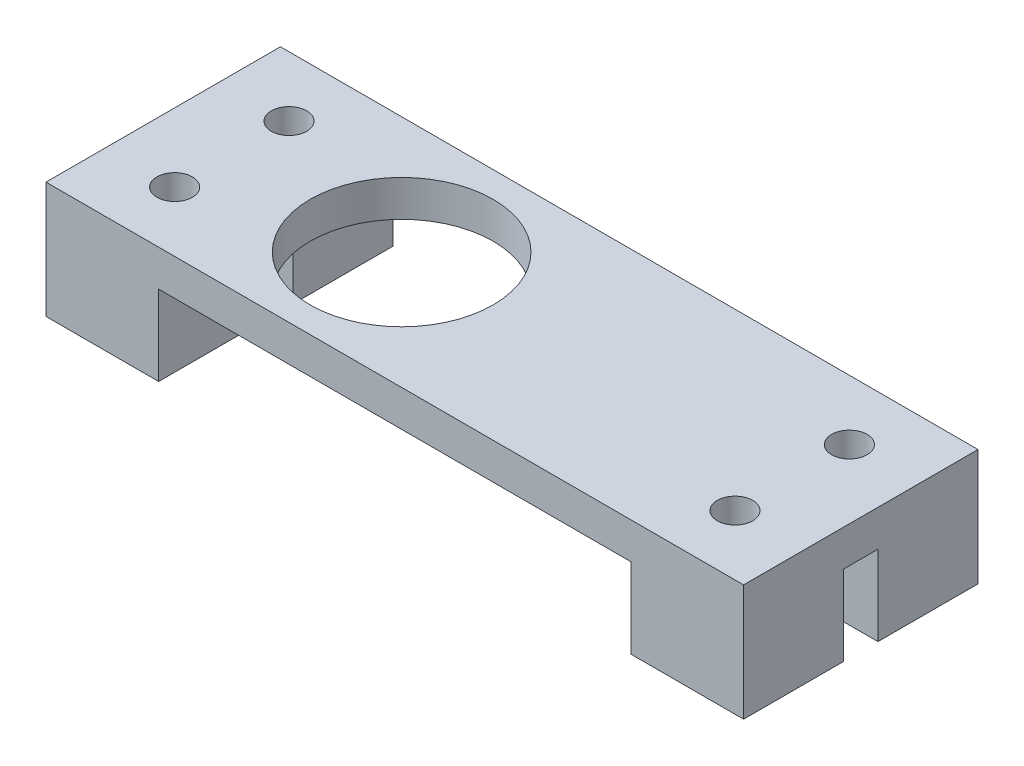
ISO-10303-21;
HEADER;
FILE_DESCRIPTION(('STEP AP214'),'2;1');
FILE_NAME('part.step','',(''),(''),'','','');
FILE_SCHEMA(('AUTOMOTIVE_DESIGN { 1 0 10303 214 1 1 1 1 }'));
ENDSEC;
DATA;
#1=APPLICATION_CONTEXT('core data for automotive mechanical design processes');
#2=APPLICATION_PROTOCOL_DEFINITION('international standard','automotive_design',2000,#1);
#3=PRODUCT_CONTEXT('',#1,'mechanical');
#4=PRODUCT('Part','Part','',(#3));
#5=PRODUCT_RELATED_PRODUCT_CATEGORY('part','',(#4));
#6=PRODUCT_DEFINITION_FORMATION('','',#4);
#7=PRODUCT_DEFINITION_CONTEXT('part definition',#1,'design');
#8=PRODUCT_DEFINITION('design','',#6,#7);
#9=PRODUCT_DEFINITION_SHAPE('','',#8);
#10=(LENGTH_UNIT() NAMED_UNIT(*) SI_UNIT(.MILLI.,.METRE.));
#11=(NAMED_UNIT(*) PLANE_ANGLE_UNIT() SI_UNIT($,.RADIAN.));
#12=(NAMED_UNIT(*) SI_UNIT($,.STERADIAN.) SOLID_ANGLE_UNIT());
#13=UNCERTAINTY_MEASURE_WITH_UNIT(LENGTH_MEASURE(1.E-05),#10,'distance_accuracy_value','');
#14=(GEOMETRIC_REPRESENTATION_CONTEXT(3) GLOBAL_UNCERTAINTY_ASSIGNED_CONTEXT((#13)) GLOBAL_UNIT_ASSIGNED_CONTEXT((#10,
#11,#12)) REPRESENTATION_CONTEXT('',''));
#15=CARTESIAN_POINT('',(0.,0.,0.));
#16=DIRECTION('',(0.,0.,1.));
#17=DIRECTION('',(1.,0.,0.));
#18=AXIS2_PLACEMENT_3D('',#15,#16,#17);
#19=CARTESIAN_POINT('',(0.,0.,0.));
#20=DIRECTION('',(0.,1.,0.));
#21=DIRECTION('',(0.,0.,1.));
#22=AXIS2_PLACEMENT_3D('',#19,#20,#21);
#23=PLANE('',#22);
#24=CARTESIAN_POINT('',(-9.65,0.,0.));
#25=DIRECTION('',(0.,1.,0.));
#26=DIRECTION('',(0.,0.,1.));
#27=AXIS2_PLACEMENT_3D('',#24,#25,#26);
#28=CIRCLE('',#27,8.);
#29=CARTESIAN_POINT('',(-9.65,0.,8.));
#30=VERTEX_POINT('',#29);
#31=EDGE_CURVE('E261',#30,#30,#28,.T.);
#32=ORIENTED_EDGE('',*,*,#31,.T.);
#33=EDGE_LOOP('',(#32));
#34=FACE_BOUND('',#33,.T.);
#35=DIRECTION('',(0.,0.,-1.));
#36=VECTOR('',#35,1.);
#37=CARTESIAN_POINT('',(20.65,0.,0.));
#38=LINE('',#37,#36);
#39=CARTESIAN_POINT('',(20.65,0.,-1.5));
#40=VERTEX_POINT('',#39);
#41=CARTESIAN_POINT('',(20.65,0.,-10.25));
#42=VERTEX_POINT('',#41);
#43=EDGE_CURVE('E51',#40,#42,#38,.T.);
#44=ORIENTED_EDGE('',*,*,#43,.F.);
#45=DIRECTION('',(1.,0.,0.));
#46=VECTOR('',#45,1.);
#47=CARTESIAN_POINT('',(0.,0.,-1.5));
#48=LINE('',#47,#46);
#49=CARTESIAN_POINT('',(30.5,0.,-1.5));
#50=VERTEX_POINT('',#49);
#51=EDGE_CURVE('E56',#40,#50,#48,.T.);
#52=ORIENTED_EDGE('',*,*,#51,.T.);
#53=DIRECTION('',(0.,0.,1.));
#54=VECTOR('',#53,1.);
#55=CARTESIAN_POINT('',(30.5,0.,0.));
#56=LINE('',#55,#54);
#57=CARTESIAN_POINT('',(30.5,0.,1.5));
#58=VERTEX_POINT('',#57);
#59=EDGE_CURVE('E292',#50,#58,#56,.T.);
#60=ORIENTED_EDGE('',*,*,#59,.T.);
#61=DIRECTION('',(1.,0.,0.));
#62=VECTOR('',#61,1.);
#63=CARTESIAN_POINT('',(0.,0.,1.5));
#64=LINE('',#63,#62);
#65=CARTESIAN_POINT('',(20.65,0.,1.5));
#66=VERTEX_POINT('',#65);
#67=EDGE_CURVE('E186',#66,#58,#64,.T.);
#68=ORIENTED_EDGE('',*,*,#67,.F.);
#69=DIRECTION('',(0.,0.,-1.));
#70=VECTOR('',#69,1.);
#71=CARTESIAN_POINT('',(20.65,0.,0.));
#72=LINE('',#71,#70);
#73=CARTESIAN_POINT('',(20.65,0.,10.25));
#74=VERTEX_POINT('',#73);
#75=EDGE_CURVE('E153',#74,#66,#72,.T.);
#76=ORIENTED_EDGE('',*,*,#75,.F.);
#77=DIRECTION('',(1.,0.,0.));
#78=VECTOR('',#77,1.);
#79=CARTESIAN_POINT('',(0.,0.,10.25));
#80=LINE('',#79,#78);
#81=CARTESIAN_POINT('',(-20.65,0.,10.25));
#82=VERTEX_POINT('',#81);
#83=EDGE_CURVE('E266',#82,#74,#80,.T.);
#84=ORIENTED_EDGE('',*,*,#83,.F.);
#85=DIRECTION('',(0.,0.,-1.));
#86=VECTOR('',#85,1.);
#87=CARTESIAN_POINT('',(-20.65,0.,0.));
#88=LINE('',#87,#86);
#89=CARTESIAN_POINT('',(-20.65,0.,1.5));
#90=VERTEX_POINT('',#89);
#91=EDGE_CURVE('E238',#82,#90,#88,.T.);
#92=ORIENTED_EDGE('',*,*,#91,.T.);
#93=DIRECTION('',(1.,0.,0.));
#94=VECTOR('',#93,1.);
#95=CARTESIAN_POINT('',(0.,0.,1.5));
#96=LINE('',#95,#94);
#97=CARTESIAN_POINT('',(-30.5,0.,1.5));
#98=VERTEX_POINT('',#97);
#99=EDGE_CURVE('E233',#98,#90,#96,.T.);
#100=ORIENTED_EDGE('',*,*,#99,.F.);
#101=DIRECTION('',(0.,0.,1.));
#102=VECTOR('',#101,1.);
#103=CARTESIAN_POINT('',(-30.5,0.,0.));
#104=LINE('',#103,#102);
#105=CARTESIAN_POINT('',(-30.5,0.,-1.5));
#106=VERTEX_POINT('',#105);
#107=EDGE_CURVE('E296',#106,#98,#104,.T.);
#108=ORIENTED_EDGE('',*,*,#107,.F.);
#109=DIRECTION('',(1.,0.,0.));
#110=VECTOR('',#109,1.);
#111=CARTESIAN_POINT('',(0.,0.,-1.5));
#112=LINE('',#111,#110);
#113=CARTESIAN_POINT('',(-20.65,0.,-1.5));
#114=VERTEX_POINT('',#113);
#115=EDGE_CURVE('E207',#106,#114,#112,.T.);
#116=ORIENTED_EDGE('',*,*,#115,.T.);
#117=DIRECTION('',(0.,0.,-1.));
#118=VECTOR('',#117,1.);
#119=CARTESIAN_POINT('',(-20.65,0.,0.));
#120=LINE('',#119,#118);
#121=CARTESIAN_POINT('',(-20.65,0.,-10.25));
#122=VERTEX_POINT('',#121);
#123=EDGE_CURVE('E212',#114,#122,#120,.T.);
#124=ORIENTED_EDGE('',*,*,#123,.T.);
#125=DIRECTION('',(1.,0.,0.));
#126=VECTOR('',#125,1.);
#127=CARTESIAN_POINT('',(0.,0.,-10.25));
#128=LINE('',#127,#126);
#129=EDGE_CURVE('E294',#122,#42,#128,.T.);
#130=ORIENTED_EDGE('',*,*,#129,.T.);
#131=EDGE_LOOP('',(#44,#52,#60,#68,#76,#84,#92,#100,#108,#116,#124,#130));
#132=FACE_BOUND('',#131,.T.);
#133=ADVANCED_FACE('F36',(#34,#132),#23,.F.);
#134=CARTESIAN_POINT('',(30.5,3.175,0.));
#135=DIRECTION('',(1.,0.,0.));
#136=DIRECTION('',(0.,0.,-1.));
#137=AXIS2_PLACEMENT_3D('',#134,#135,#136);
#138=PLANE('',#137);
#139=ORIENTED_EDGE('',*,*,#59,.F.);
#140=DIRECTION('',(0.,1.,0.));
#141=VECTOR('',#140,1.);
#142=CARTESIAN_POINT('',(30.5,-7.,-1.5));
#143=LINE('',#142,#141);
#144=CARTESIAN_POINT('',(30.5,-7.,-1.5));
#145=VERTEX_POINT('',#144);
#146=EDGE_CURVE('E178',#145,#50,#143,.T.);
#147=ORIENTED_EDGE('',*,*,#146,.F.);
#148=DIRECTION('',(0.,0.,1.));
#149=VECTOR('',#148,1.);
#150=CARTESIAN_POINT('',(30.5,-7.,0.));
#151=LINE('',#150,#149);
#152=CARTESIAN_POINT('',(30.5,-7.,-10.25));
#153=VERTEX_POINT('',#152);
#154=EDGE_CURVE('E168',#153,#145,#151,.T.);
#155=ORIENTED_EDGE('',*,*,#154,.F.);
#156=DIRECTION('',(0.,-1.,0.));
#157=VECTOR('',#156,1.);
#158=CARTESIAN_POINT('',(30.5,3.175,-10.25));
#159=LINE('',#158,#157);
#160=CARTESIAN_POINT('',(30.5,3.175,-10.25));
#161=VERTEX_POINT('',#160);
#162=EDGE_CURVE('E11',#161,#153,#159,.T.);
#163=ORIENTED_EDGE('',*,*,#162,.F.);
#164=DIRECTION('',(0.,0.,1.));
#165=VECTOR('',#164,1.);
#166=CARTESIAN_POINT('',(30.5,3.175,0.));
#167=LINE('',#166,#165);
#168=CARTESIAN_POINT('',(30.5,3.175,10.25));
#169=VERTEX_POINT('',#168);
#170=EDGE_CURVE('E278',#161,#169,#167,.T.);
#171=ORIENTED_EDGE('',*,*,#170,.T.);
#172=DIRECTION('',(0.,-1.,0.));
#173=VECTOR('',#172,1.);
#174=CARTESIAN_POINT('',(30.5,3.175,10.25));
#175=LINE('',#174,#173);
#176=CARTESIAN_POINT('',(30.5,-7.,10.25));
#177=VERTEX_POINT('',#176);
#178=EDGE_CURVE('E289',#169,#177,#175,.T.);
#179=ORIENTED_EDGE('',*,*,#178,.T.);
#180=DIRECTION('',(0.,0.,1.));
#181=VECTOR('',#180,1.);
#182=CARTESIAN_POINT('',(30.5,-7.,0.));
#183=LINE('',#182,#181);
#184=CARTESIAN_POINT('',(30.5,-7.,1.5));
#185=VERTEX_POINT('',#184);
#186=EDGE_CURVE('E191',#185,#177,#183,.T.);
#187=ORIENTED_EDGE('',*,*,#186,.F.);
#188=DIRECTION('',(0.,1.,0.));
#189=VECTOR('',#188,1.);
#190=CARTESIAN_POINT('',(30.5,-7.,1.5));
#191=LINE('',#190,#189);
#192=EDGE_CURVE('E202',#185,#58,#191,.T.);
#193=ORIENTED_EDGE('',*,*,#192,.T.);
#194=EDGE_LOOP('',(#139,#147,#155,#163,#171,#179,#187,#193));
#195=FACE_BOUND('',#194,.T.);
#196=ADVANCED_FACE('F344',(#195),#138,.T.);
#197=CARTESIAN_POINT('',(0.,3.175,-10.25));
#198=DIRECTION('',(0.,0.,-1.));
#199=DIRECTION('',(-1.,0.,0.));
#200=AXIS2_PLACEMENT_3D('',#197,#198,#199);
#201=PLANE('',#200);
#202=ORIENTED_EDGE('',*,*,#129,.F.);
#203=DIRECTION('',(0.,1.,0.));
#204=VECTOR('',#203,1.);
#205=CARTESIAN_POINT('',(-20.65,-7.,-10.25));
#206=LINE('',#205,#204);
#207=CARTESIAN_POINT('',(-20.65,-7.,-10.25));
#208=VERTEX_POINT('',#207);
#209=EDGE_CURVE('E229',#208,#122,#206,.T.);
#210=ORIENTED_EDGE('',*,*,#209,.F.);
#211=DIRECTION('',(1.,0.,0.));
#212=VECTOR('',#211,1.);
#213=CARTESIAN_POINT('',(0.,-7.,-10.25));
#214=LINE('',#213,#212);
#215=CARTESIAN_POINT('',(-30.5,-7.,-10.25));
#216=VERTEX_POINT('',#215);
#217=EDGE_CURVE('E215',#216,#208,#214,.T.);
#218=ORIENTED_EDGE('',*,*,#217,.F.);
#219=DIRECTION('',(0.,-1.,0.));
#220=VECTOR('',#219,1.);
#221=CARTESIAN_POINT('',(-30.5,3.175,-10.25));
#222=LINE('',#221,#220);
#223=CARTESIAN_POINT('',(-30.5,3.175,-10.25));
#224=VERTEX_POINT('',#223);
#225=EDGE_CURVE('E44',#224,#216,#222,.T.);
#226=ORIENTED_EDGE('',*,*,#225,.F.);
#227=DIRECTION('',(1.,0.,0.));
#228=VECTOR('',#227,1.);
#229=CARTESIAN_POINT('',(0.,3.175,-10.25));
#230=LINE('',#229,#228);
#231=EDGE_CURVE('E281',#224,#161,#230,.T.);
#232=ORIENTED_EDGE('',*,*,#231,.T.);
#233=ORIENTED_EDGE('',*,*,#162,.T.);
#234=DIRECTION('',(1.,0.,0.));
#235=VECTOR('',#234,1.);
#236=CARTESIAN_POINT('',(0.,-7.,-10.25));
#237=LINE('',#236,#235);
#238=CARTESIAN_POINT('',(20.65,-7.,-10.25));
#239=VERTEX_POINT('',#238);
#240=EDGE_CURVE('E163',#239,#153,#237,.T.);
#241=ORIENTED_EDGE('',*,*,#240,.F.);
#242=DIRECTION('',(0.,1.,0.));
#243=VECTOR('',#242,1.);
#244=CARTESIAN_POINT('',(20.65,-7.,-10.25));
#245=LINE('',#244,#243);
#246=EDGE_CURVE('E154',#239,#42,#245,.T.);
#247=ORIENTED_EDGE('',*,*,#246,.T.);
#248=EDGE_LOOP('',(#202,#210,#218,#226,#232,#233,#241,#247));
#249=FACE_BOUND('',#248,.T.);
#250=ADVANCED_FACE('F317',(#249),#201,.T.);
#251=CARTESIAN_POINT('',(-30.5,3.175,0.));
#252=DIRECTION('',(1.,0.,0.));
#253=DIRECTION('',(0.,0.,-1.));
#254=AXIS2_PLACEMENT_3D('',#251,#252,#253);
#255=PLANE('',#254);
#256=ORIENTED_EDGE('',*,*,#225,.T.);
#257=DIRECTION('',(0.,0.,-1.));
#258=VECTOR('',#257,1.);
#259=CARTESIAN_POINT('',(-30.5,-7.,0.));
#260=LINE('',#259,#258);
#261=CARTESIAN_POINT('',(-30.5,-7.,-1.5));
#262=VERTEX_POINT('',#261);
#263=EDGE_CURVE('E211',#262,#216,#260,.T.);
#264=ORIENTED_EDGE('',*,*,#263,.F.);
#265=DIRECTION('',(0.,1.,0.));
#266=VECTOR('',#265,1.);
#267=CARTESIAN_POINT('',(-30.5,-7.,-1.5));
#268=LINE('',#267,#266);
#269=EDGE_CURVE('E231',#262,#106,#268,.T.);
#270=ORIENTED_EDGE('',*,*,#269,.T.);
#271=ORIENTED_EDGE('',*,*,#107,.T.);
#272=DIRECTION('',(0.,1.,0.));
#273=VECTOR('',#272,1.);
#274=CARTESIAN_POINT('',(-30.5,-7.,1.5));
#275=LINE('',#274,#273);
#276=CARTESIAN_POINT('',(-30.5,-7.,1.5));
#277=VERTEX_POINT('',#276);
#278=EDGE_CURVE('E258',#277,#98,#275,.T.);
#279=ORIENTED_EDGE('',*,*,#278,.F.);
#280=DIRECTION('',(0.,0.,-1.));
#281=VECTOR('',#280,1.);
#282=CARTESIAN_POINT('',(-30.5,-7.,0.));
#283=LINE('',#282,#281);
#284=CARTESIAN_POINT('',(-30.5,-7.,10.25));
#285=VERTEX_POINT('',#284);
#286=EDGE_CURVE('E237',#285,#277,#283,.T.);
#287=ORIENTED_EDGE('',*,*,#286,.F.);
#288=DIRECTION('',(0.,-1.,0.));
#289=VECTOR('',#288,1.);
#290=CARTESIAN_POINT('',(-30.5,3.175,10.25));
#291=LINE('',#290,#289);
#292=CARTESIAN_POINT('',(-30.5,3.175,10.25));
#293=VERTEX_POINT('',#292);
#294=EDGE_CURVE('E301',#293,#285,#291,.T.);
#295=ORIENTED_EDGE('',*,*,#294,.F.);
#296=DIRECTION('',(0.,0.,1.));
#297=VECTOR('',#296,1.);
#298=CARTESIAN_POINT('',(-30.5,3.175,0.));
#299=LINE('',#298,#297);
#300=EDGE_CURVE('E284',#224,#293,#299,.T.);
#301=ORIENTED_EDGE('',*,*,#300,.F.);
#302=EDGE_LOOP('',(#256,#264,#270,#271,#279,#287,#295,#301));
#303=FACE_BOUND('',#302,.T.);
#304=ADVANCED_FACE('F305',(#303),#255,.F.);
#305=CARTESIAN_POINT('',(-9.65,3.175,0.));
#306=DIRECTION('',(0.,-1.,0.));
#307=DIRECTION('',(0.,0.,-1.));
#308=AXIS2_PLACEMENT_3D('',#305,#306,#307);
#309=CYLINDRICAL_SURFACE('',#308,8.);
#310=CARTESIAN_POINT('',(-9.65,3.175,0.));
#311=DIRECTION('',(0.,1.,0.));
#312=DIRECTION('',(0.,0.,1.));
#313=AXIS2_PLACEMENT_3D('',#310,#311,#312);
#314=CIRCLE('',#313,8.);
#315=CARTESIAN_POINT('',(-9.65,3.175,8.));
#316=VERTEX_POINT('',#315);
#317=EDGE_CURVE('E275',#316,#316,#314,.T.);
#318=ORIENTED_EDGE('',*,*,#317,.T.);
#319=EDGE_LOOP('',(#318));
#320=FACE_BOUND('',#319,.T.);
#321=ORIENTED_EDGE('',*,*,#31,.F.);
#322=EDGE_LOOP('',(#321));
#323=FACE_BOUND('',#322,.T.);
#324=ADVANCED_FACE('F380',(#320,#323),#309,.F.);
#325=CARTESIAN_POINT('',(-24.5,3.175,-5.));
#326=DIRECTION('',(0.,-1.,0.));
#327=DIRECTION('',(0.,0.,-1.));
#328=AXIS2_PLACEMENT_3D('',#325,#326,#327);
#329=CYLINDRICAL_SURFACE('',#328,1.55);
#330=CARTESIAN_POINT('',(-24.5,3.175,-5.));
#331=DIRECTION('',(0.,1.,0.));
#332=DIRECTION('',(0.,0.,1.));
#333=AXIS2_PLACEMENT_3D('',#330,#331,#332);
#334=CIRCLE('',#333,1.55);
#335=CARTESIAN_POINT('',(-24.5,3.175,-3.45));
#336=VERTEX_POINT('',#335);
#337=EDGE_CURVE('E272',#336,#336,#334,.T.);
#338=ORIENTED_EDGE('',*,*,#337,.T.);
#339=EDGE_LOOP('',(#338));
#340=FACE_BOUND('',#339,.T.);
#341=CARTESIAN_POINT('',(-24.5,-7.,-5.));
#342=DIRECTION('',(0.,-1.,0.));
#343=DIRECTION('',(0.,0.,-1.));
#344=AXIS2_PLACEMENT_3D('',#341,#342,#343);
#345=CIRCLE('',#344,1.55);
#346=CARTESIAN_POINT('',(-24.5,-7.,-6.55));
#347=VERTEX_POINT('',#346);
#348=EDGE_CURVE('E220',#347,#347,#345,.F.);
#349=ORIENTED_EDGE('',*,*,#348,.F.);
#350=EDGE_LOOP('',(#349));
#351=FACE_BOUND('',#350,.T.);
#352=ADVANCED_FACE('F385',(#340,#351),#329,.F.);
#353=CARTESIAN_POINT('',(-24.5,3.175,5.));
#354=DIRECTION('',(0.,-1.,0.));
#355=DIRECTION('',(0.,0.,-1.));
#356=AXIS2_PLACEMENT_3D('',#353,#354,#355);
#357=CYLINDRICAL_SURFACE('',#356,1.55);
#358=CARTESIAN_POINT('',(-24.5,3.175,5.));
#359=DIRECTION('',(0.,1.,0.));
#360=DIRECTION('',(0.,0.,1.));
#361=AXIS2_PLACEMENT_3D('',#358,#359,#360);
#362=CIRCLE('',#361,1.55);
#363=CARTESIAN_POINT('',(-24.5,3.175,6.55));
#364=VERTEX_POINT('',#363);
#365=EDGE_CURVE('E269',#364,#364,#362,.T.);
#366=ORIENTED_EDGE('',*,*,#365,.T.);
#367=EDGE_LOOP('',(#366));
#368=FACE_BOUND('',#367,.T.);
#369=CARTESIAN_POINT('',(-24.5,-7.,5.));
#370=DIRECTION('',(0.,-1.,0.));
#371=DIRECTION('',(0.,0.,-1.));
#372=AXIS2_PLACEMENT_3D('',#369,#370,#371);
#373=CIRCLE('',#372,1.55);
#374=CARTESIAN_POINT('',(-24.5,-7.,3.45));
#375=VERTEX_POINT('',#374);
#376=EDGE_CURVE('E234',#375,#375,#373,.F.);
#377=ORIENTED_EDGE('',*,*,#376,.F.);
#378=EDGE_LOOP('',(#377));
#379=FACE_BOUND('',#378,.T.);
#380=ADVANCED_FACE('F389',(#368,#379),#357,.F.);
#381=CARTESIAN_POINT('',(24.5,3.175,-5.00000000000001));
#382=DIRECTION('',(0.,-1.,0.));
#383=DIRECTION('',(0.,0.,-1.));
#384=AXIS2_PLACEMENT_3D('',#381,#382,#383);
#385=CYLINDRICAL_SURFACE('',#384,1.55);
#386=CARTESIAN_POINT('',(24.5,3.175,-5.00000000000001));
#387=DIRECTION('',(0.,1.,0.));
#388=DIRECTION('',(0.,0.,1.));
#389=AXIS2_PLACEMENT_3D('',#386,#387,#388);
#390=CIRCLE('',#389,1.55);
#391=CARTESIAN_POINT('',(24.5,3.175,-3.45000000000001));
#392=VERTEX_POINT('',#391);
#393=EDGE_CURVE('E265',#392,#392,#390,.T.);
#394=ORIENTED_EDGE('',*,*,#393,.T.);
#395=EDGE_LOOP('',(#394));
#396=FACE_BOUND('',#395,.T.);
#397=CARTESIAN_POINT('',(24.5,-7.,-5.00000000000001));
#398=DIRECTION('',(0.,-1.,0.));
#399=DIRECTION('',(0.,0.,-1.));
#400=AXIS2_PLACEMENT_3D('',#397,#398,#399);
#401=CIRCLE('',#400,1.55);
#402=CARTESIAN_POINT('',(24.5,-7.,-6.55000000000001));
#403=VERTEX_POINT('',#402);
#404=EDGE_CURVE('E175',#403,#403,#401,.F.);
#405=ORIENTED_EDGE('',*,*,#404,.F.);
#406=EDGE_LOOP('',(#405));
#407=FACE_BOUND('',#406,.T.);
#408=ADVANCED_FACE('F392',(#396,#407),#385,.F.);
#409=CARTESIAN_POINT('',(24.5,3.175,5.00000000000001));
#410=DIRECTION('',(0.,-1.,0.));
#411=DIRECTION('',(0.,0.,-1.));
#412=AXIS2_PLACEMENT_3D('',#409,#410,#411);
#413=CYLINDRICAL_SURFACE('',#412,1.55);
#414=CARTESIAN_POINT('',(24.5,3.175,5.00000000000001));
#415=DIRECTION('',(0.,1.,0.));
#416=DIRECTION('',(0.,0.,1.));
#417=AXIS2_PLACEMENT_3D('',#414,#415,#416);
#418=CIRCLE('',#417,1.55);
#419=CARTESIAN_POINT('',(24.5,3.175,6.55000000000001));
#420=VERTEX_POINT('',#419);
#421=EDGE_CURVE('E262',#420,#420,#418,.T.);
#422=ORIENTED_EDGE('',*,*,#421,.T.);
#423=EDGE_LOOP('',(#422));
#424=FACE_BOUND('',#423,.T.);
#425=CARTESIAN_POINT('',(24.5,-7.,5.00000000000001));
#426=DIRECTION('',(0.,-1.,0.));
#427=DIRECTION('',(0.,0.,-1.));
#428=AXIS2_PLACEMENT_3D('',#425,#426,#427);
#429=CIRCLE('',#428,1.55);
#430=CARTESIAN_POINT('',(24.5,-7.,3.45000000000001));
#431=VERTEX_POINT('',#430);
#432=EDGE_CURVE('E182',#431,#431,#429,.F.);
#433=ORIENTED_EDGE('',*,*,#432,.F.);
#434=EDGE_LOOP('',(#433));
#435=FACE_BOUND('',#434,.T.);
#436=ADVANCED_FACE('F38',(#424,#435),#413,.F.);
#437=CARTESIAN_POINT('',(0.,3.175,10.25));
#438=DIRECTION('',(0.,0.,-1.));
#439=DIRECTION('',(-1.,0.,0.));
#440=AXIS2_PLACEMENT_3D('',#437,#438,#439);
#441=PLANE('',#440);
#442=ORIENTED_EDGE('',*,*,#294,.T.);
#443=DIRECTION('',(-1.,0.,0.));
#444=VECTOR('',#443,1.);
#445=CARTESIAN_POINT('',(0.,-7.,10.25));
#446=LINE('',#445,#444);
#447=CARTESIAN_POINT('',(-20.65,-7.,10.25));
#448=VERTEX_POINT('',#447);
#449=EDGE_CURVE('E246',#448,#285,#446,.T.);
#450=ORIENTED_EDGE('',*,*,#449,.F.);
#451=DIRECTION('',(0.,1.,0.));
#452=VECTOR('',#451,1.);
#453=CARTESIAN_POINT('',(-20.65,-7.,10.25));
#454=LINE('',#453,#452);
#455=EDGE_CURVE('E249',#448,#82,#454,.T.);
#456=ORIENTED_EDGE('',*,*,#455,.T.);
#457=ORIENTED_EDGE('',*,*,#83,.T.);
#458=DIRECTION('',(0.,1.,0.));
#459=VECTOR('',#458,1.);
#460=CARTESIAN_POINT('',(20.65,-7.,10.25));
#461=LINE('',#460,#459);
#462=CARTESIAN_POINT('',(20.65,-7.,10.25));
#463=VERTEX_POINT('',#462);
#464=EDGE_CURVE('E196',#463,#74,#461,.T.);
#465=ORIENTED_EDGE('',*,*,#464,.F.);
#466=DIRECTION('',(-1.,0.,0.));
#467=VECTOR('',#466,1.);
#468=CARTESIAN_POINT('',(0.,-7.,10.25));
#469=LINE('',#468,#467);
#470=EDGE_CURVE('E194',#177,#463,#469,.T.);
#471=ORIENTED_EDGE('',*,*,#470,.F.);
#472=ORIENTED_EDGE('',*,*,#178,.F.);
#473=DIRECTION('',(1.,0.,0.));
#474=VECTOR('',#473,1.);
#475=CARTESIAN_POINT('',(0.,3.175,10.25));
#476=LINE('',#475,#474);
#477=EDGE_CURVE('E287',#293,#169,#476,.T.);
#478=ORIENTED_EDGE('',*,*,#477,.F.);
#479=EDGE_LOOP('',(#442,#450,#456,#457,#465,#471,#472,#478));
#480=FACE_BOUND('',#479,.T.);
#481=ADVANCED_FACE('F337',(#480),#441,.F.);
#482=CARTESIAN_POINT('',(0.,3.175,0.));
#483=DIRECTION('',(0.,1.,0.));
#484=DIRECTION('',(0.,0.,1.));
#485=AXIS2_PLACEMENT_3D('',#482,#483,#484);
#486=PLANE('',#485);
#487=ORIENTED_EDGE('',*,*,#421,.F.);
#488=EDGE_LOOP('',(#487));
#489=FACE_BOUND('',#488,.T.);
#490=ORIENTED_EDGE('',*,*,#393,.F.);
#491=EDGE_LOOP('',(#490));
#492=FACE_BOUND('',#491,.T.);
#493=ORIENTED_EDGE('',*,*,#365,.F.);
#494=EDGE_LOOP('',(#493));
#495=FACE_BOUND('',#494,.T.);
#496=ORIENTED_EDGE('',*,*,#337,.F.);
#497=EDGE_LOOP('',(#496));
#498=FACE_BOUND('',#497,.T.);
#499=ORIENTED_EDGE('',*,*,#317,.F.);
#500=EDGE_LOOP('',(#499));
#501=FACE_BOUND('',#500,.T.);
#502=ORIENTED_EDGE('',*,*,#170,.F.);
#503=ORIENTED_EDGE('',*,*,#231,.F.);
#504=ORIENTED_EDGE('',*,*,#300,.T.);
#505=ORIENTED_EDGE('',*,*,#477,.T.);
#506=EDGE_LOOP('',(#502,#503,#504,#505));
#507=FACE_BOUND('',#506,.T.);
#508=ADVANCED_FACE('F342',(#489,#492,#495,#498,#501,#507),#486,.T.);
#509=CARTESIAN_POINT('',(0.,-7.,1.5));
#510=DIRECTION('',(0.,0.,1.));
#511=DIRECTION('',(1.,0.,0.));
#512=AXIS2_PLACEMENT_3D('',#509,#510,#511);
#513=PLANE('',#512);
#514=ORIENTED_EDGE('',*,*,#99,.T.);
#515=DIRECTION('',(0.,1.,0.));
#516=VECTOR('',#515,1.);
#517=CARTESIAN_POINT('',(-20.65,-7.,1.5));
#518=LINE('',#517,#516);
#519=CARTESIAN_POINT('',(-20.65,-7.,1.5));
#520=VERTEX_POINT('',#519);
#521=EDGE_CURVE('E255',#520,#90,#518,.T.);
#522=ORIENTED_EDGE('',*,*,#521,.F.);
#523=DIRECTION('',(1.,0.,0.));
#524=VECTOR('',#523,1.);
#525=CARTESIAN_POINT('',(0.,-7.,1.5));
#526=LINE('',#525,#524);
#527=EDGE_CURVE('E241',#277,#520,#526,.T.);
#528=ORIENTED_EDGE('',*,*,#527,.F.);
#529=ORIENTED_EDGE('',*,*,#278,.T.);
#530=EDGE_LOOP('',(#514,#522,#528,#529));
#531=FACE_BOUND('',#530,.T.);
#532=ADVANCED_FACE('F331',(#531),#513,.F.);
#533=CARTESIAN_POINT('',(-20.65,-7.,0.));
#534=DIRECTION('',(1.,0.,0.));
#535=DIRECTION('',(0.,0.,-1.));
#536=AXIS2_PLACEMENT_3D('',#533,#534,#535);
#537=PLANE('',#536);
#538=ORIENTED_EDGE('',*,*,#91,.F.);
#539=ORIENTED_EDGE('',*,*,#455,.F.);
#540=DIRECTION('',(0.,0.,-1.));
#541=VECTOR('',#540,1.);
#542=CARTESIAN_POINT('',(-20.65,-7.,0.));
#543=LINE('',#542,#541);
#544=EDGE_CURVE('E243',#448,#520,#543,.T.);
#545=ORIENTED_EDGE('',*,*,#544,.T.);
#546=ORIENTED_EDGE('',*,*,#521,.T.);
#547=EDGE_LOOP('',(#538,#539,#545,#546));
#548=FACE_BOUND('',#547,.T.);
#549=ADVANCED_FACE('F357',(#548),#537,.T.);
#550=CARTESIAN_POINT('',(0.,-7.,0.));
#551=DIRECTION('',(0.,-1.,0.));
#552=DIRECTION('',(0.,0.,-1.));
#553=AXIS2_PLACEMENT_3D('',#550,#551,#552);
#554=PLANE('',#553);
#555=ORIENTED_EDGE('',*,*,#376,.T.);
#556=EDGE_LOOP('',(#555));
#557=FACE_BOUND('',#556,.T.);
#558=ORIENTED_EDGE('',*,*,#286,.T.);
#559=ORIENTED_EDGE('',*,*,#527,.T.);
#560=ORIENTED_EDGE('',*,*,#544,.F.);
#561=ORIENTED_EDGE('',*,*,#449,.T.);
#562=EDGE_LOOP('',(#558,#559,#560,#561));
#563=FACE_BOUND('',#562,.T.);
#564=ADVANCED_FACE('F334',(#557,#563),#554,.T.);
#565=CARTESIAN_POINT('',(0.,-7.,-1.5));
#566=DIRECTION('',(0.,0.,1.));
#567=DIRECTION('',(1.,0.,0.));
#568=AXIS2_PLACEMENT_3D('',#565,#566,#567);
#569=PLANE('',#568);
#570=ORIENTED_EDGE('',*,*,#115,.F.);
#571=ORIENTED_EDGE('',*,*,#269,.F.);
#572=DIRECTION('',(1.,0.,0.));
#573=VECTOR('',#572,1.);
#574=CARTESIAN_POINT('',(0.,-7.,-1.5));
#575=LINE('',#574,#573);
#576=CARTESIAN_POINT('',(-20.65,-7.,-1.5));
#577=VERTEX_POINT('',#576);
#578=EDGE_CURVE('E208',#262,#577,#575,.T.);
#579=ORIENTED_EDGE('',*,*,#578,.T.);
#580=DIRECTION('',(0.,1.,0.));
#581=VECTOR('',#580,1.);
#582=CARTESIAN_POINT('',(-20.65,-7.,-1.5));
#583=LINE('',#582,#581);
#584=EDGE_CURVE('E223',#577,#114,#583,.T.);
#585=ORIENTED_EDGE('',*,*,#584,.T.);
#586=EDGE_LOOP('',(#570,#571,#579,#585));
#587=FACE_BOUND('',#586,.T.);
#588=ADVANCED_FACE('F323',(#587),#569,.T.);
#589=CARTESIAN_POINT('',(-20.65,-7.,0.));
#590=DIRECTION('',(1.,0.,0.));
#591=DIRECTION('',(0.,0.,-1.));
#592=AXIS2_PLACEMENT_3D('',#589,#590,#591);
#593=PLANE('',#592);
#594=ORIENTED_EDGE('',*,*,#123,.F.);
#595=ORIENTED_EDGE('',*,*,#584,.F.);
#596=DIRECTION('',(0.,0.,-1.));
#597=VECTOR('',#596,1.);
#598=CARTESIAN_POINT('',(-20.65,-7.,0.));
#599=LINE('',#598,#597);
#600=EDGE_CURVE('E217',#577,#208,#599,.T.);
#601=ORIENTED_EDGE('',*,*,#600,.T.);
#602=ORIENTED_EDGE('',*,*,#209,.T.);
#603=EDGE_LOOP('',(#594,#595,#601,#602));
#604=FACE_BOUND('',#603,.T.);
#605=ADVANCED_FACE('F320',(#604),#593,.T.);
#606=CARTESIAN_POINT('',(0.,-7.,0.));
#607=DIRECTION('',(0.,-1.,0.));
#608=DIRECTION('',(0.,0.,-1.));
#609=AXIS2_PLACEMENT_3D('',#606,#607,#608);
#610=PLANE('',#609);
#611=ORIENTED_EDGE('',*,*,#578,.F.);
#612=ORIENTED_EDGE('',*,*,#263,.T.);
#613=ORIENTED_EDGE('',*,*,#217,.T.);
#614=ORIENTED_EDGE('',*,*,#600,.F.);
#615=EDGE_LOOP('',(#611,#612,#613,#614));
#616=FACE_BOUND('',#615,.T.);
#617=ORIENTED_EDGE('',*,*,#348,.T.);
#618=EDGE_LOOP('',(#617));
#619=FACE_BOUND('',#618,.T.);
#620=ADVANCED_FACE('F312',(#616,#619),#610,.T.);
#621=CARTESIAN_POINT('',(20.65,-7.,0.));
#622=DIRECTION('',(1.,0.,0.));
#623=DIRECTION('',(0.,0.,-1.));
#624=AXIS2_PLACEMENT_3D('',#621,#622,#623);
#625=PLANE('',#624);
#626=ORIENTED_EDGE('',*,*,#75,.T.);
#627=DIRECTION('',(0.,1.,0.));
#628=VECTOR('',#627,1.);
#629=CARTESIAN_POINT('',(20.65,-7.,1.5));
#630=LINE('',#629,#628);
#631=CARTESIAN_POINT('',(20.65,-7.,1.5));
#632=VERTEX_POINT('',#631);
#633=EDGE_CURVE('E205',#632,#66,#630,.T.);
#634=ORIENTED_EDGE('',*,*,#633,.F.);
#635=DIRECTION('',(0.,0.,-1.));
#636=VECTOR('',#635,1.);
#637=CARTESIAN_POINT('',(20.65,-7.,0.));
#638=LINE('',#637,#636);
#639=EDGE_CURVE('E185',#463,#632,#638,.T.);
#640=ORIENTED_EDGE('',*,*,#639,.F.);
#641=ORIENTED_EDGE('',*,*,#464,.T.);
#642=EDGE_LOOP('',(#626,#634,#640,#641));
#643=FACE_BOUND('',#642,.T.);
#644=ADVANCED_FACE('F354',(#643),#625,.F.);
#645=CARTESIAN_POINT('',(0.,-7.,1.5));
#646=DIRECTION('',(0.,0.,1.));
#647=DIRECTION('',(1.,0.,0.));
#648=AXIS2_PLACEMENT_3D('',#645,#646,#647);
#649=PLANE('',#648);
#650=ORIENTED_EDGE('',*,*,#67,.T.);
#651=ORIENTED_EDGE('',*,*,#192,.F.);
#652=DIRECTION('',(1.,0.,0.));
#653=VECTOR('',#652,1.);
#654=CARTESIAN_POINT('',(0.,-7.,1.5));
#655=LINE('',#654,#653);
#656=EDGE_CURVE('E189',#632,#185,#655,.T.);
#657=ORIENTED_EDGE('',*,*,#656,.F.);
#658=ORIENTED_EDGE('',*,*,#633,.T.);
#659=EDGE_LOOP('',(#650,#651,#657,#658));
#660=FACE_BOUND('',#659,.T.);
#661=ADVANCED_FACE('F350',(#660),#649,.F.);
#662=CARTESIAN_POINT('',(0.,-7.,0.));
#663=DIRECTION('',(0.,-1.,0.));
#664=DIRECTION('',(0.,0.,-1.));
#665=AXIS2_PLACEMENT_3D('',#662,#663,#664);
#666=PLANE('',#665);
#667=ORIENTED_EDGE('',*,*,#432,.T.);
#668=EDGE_LOOP('',(#667));
#669=FACE_BOUND('',#668,.T.);
#670=ORIENTED_EDGE('',*,*,#639,.T.);
#671=ORIENTED_EDGE('',*,*,#656,.T.);
#672=ORIENTED_EDGE('',*,*,#186,.T.);
#673=ORIENTED_EDGE('',*,*,#470,.T.);
#674=EDGE_LOOP('',(#670,#671,#672,#673));
#675=FACE_BOUND('',#674,.T.);
#676=ADVANCED_FACE('F412',(#669,#675),#666,.T.);
#677=CARTESIAN_POINT('',(0.,-7.,-1.5));
#678=DIRECTION('',(0.,0.,1.));
#679=DIRECTION('',(1.,0.,0.));
#680=AXIS2_PLACEMENT_3D('',#677,#678,#679);
#681=PLANE('',#680);
#682=ORIENTED_EDGE('',*,*,#51,.F.);
#683=DIRECTION('',(0.,1.,0.));
#684=VECTOR('',#683,1.);
#685=CARTESIAN_POINT('',(20.65,-7.,-1.5));
#686=LINE('',#685,#684);
#687=CARTESIAN_POINT('',(20.65,-7.,-1.5));
#688=VERTEX_POINT('',#687);
#689=EDGE_CURVE('E146',#688,#40,#686,.T.);
#690=ORIENTED_EDGE('',*,*,#689,.F.);
#691=DIRECTION('',(1.,0.,0.));
#692=VECTOR('',#691,1.);
#693=CARTESIAN_POINT('',(0.,-7.,-1.5));
#694=LINE('',#693,#692);
#695=EDGE_CURVE('E151',#688,#145,#694,.T.);
#696=ORIENTED_EDGE('',*,*,#695,.T.);
#697=ORIENTED_EDGE('',*,*,#146,.T.);
#698=EDGE_LOOP('',(#682,#690,#696,#697));
#699=FACE_BOUND('',#698,.T.);
#700=ADVANCED_FACE('F148',(#699),#681,.T.);
#701=CARTESIAN_POINT('',(20.65,-7.,0.));
#702=DIRECTION('',(1.,0.,0.));
#703=DIRECTION('',(0.,0.,-1.));
#704=AXIS2_PLACEMENT_3D('',#701,#702,#703);
#705=PLANE('',#704);
#706=ORIENTED_EDGE('',*,*,#43,.T.);
#707=ORIENTED_EDGE('',*,*,#246,.F.);
#708=DIRECTION('',(0.,0.,-1.));
#709=VECTOR('',#708,1.);
#710=CARTESIAN_POINT('',(20.65,-7.,0.));
#711=LINE('',#710,#709);
#712=EDGE_CURVE('E157',#688,#239,#711,.T.);
#713=ORIENTED_EDGE('',*,*,#712,.F.);
#714=ORIENTED_EDGE('',*,*,#689,.T.);
#715=EDGE_LOOP('',(#706,#707,#713,#714));
#716=FACE_BOUND('',#715,.T.);
#717=ADVANCED_FACE('F158',(#716),#705,.F.);
#718=CARTESIAN_POINT('',(0.,-7.,0.));
#719=DIRECTION('',(0.,-1.,0.));
#720=DIRECTION('',(0.,0.,-1.));
#721=AXIS2_PLACEMENT_3D('',#718,#719,#720);
#722=PLANE('',#721);
#723=ORIENTED_EDGE('',*,*,#695,.F.);
#724=ORIENTED_EDGE('',*,*,#712,.T.);
#725=ORIENTED_EDGE('',*,*,#240,.T.);
#726=ORIENTED_EDGE('',*,*,#154,.T.);
#727=EDGE_LOOP('',(#723,#724,#725,#726));
#728=FACE_BOUND('',#727,.T.);
#729=ORIENTED_EDGE('',*,*,#404,.T.);
#730=EDGE_LOOP('',(#729));
#731=FACE_BOUND('',#730,.T.);
#732=ADVANCED_FACE('F165',(#728,#731),#722,.T.);
#733=CLOSED_SHELL('',(#133,#196,#250,#304,#324,#352,#380,#408,#436,#481,#508,#532,#549,#564,
#588,#605,#620,#644,#661,#676,#700,#717,#732));
#734=MANIFOLD_SOLID_BREP('B2',#733);
#735=ADVANCED_BREP_SHAPE_REPRESENTATION('',(#18,#734),#14);
#736=SHAPE_DEFINITION_REPRESENTATION(#9,#735);
ENDSEC;
END-ISO-10303-21;
